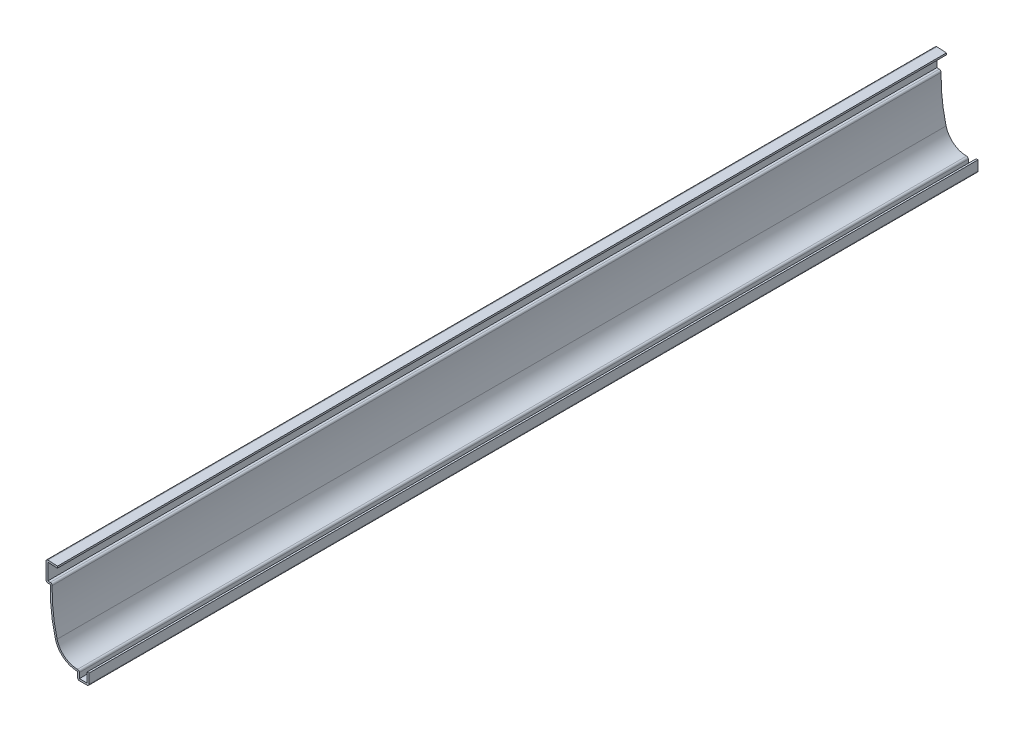
ISO-10303-21;
HEADER;
FILE_DESCRIPTION(('STEP AP214'),'2;1');
FILE_NAME('part.step','',(''),(''),'','','');
FILE_SCHEMA(('AUTOMOTIVE_DESIGN { 1 0 10303 214 1 1 1 1 }'));
ENDSEC;
DATA;
#1=APPLICATION_CONTEXT('core data for automotive mechanical design processes');
#2=APPLICATION_PROTOCOL_DEFINITION('international standard','automotive_design',2000,#1);
#3=PRODUCT_CONTEXT('',#1,'mechanical');
#4=PRODUCT('Part','Part','',(#3));
#5=PRODUCT_RELATED_PRODUCT_CATEGORY('part','',(#4));
#6=PRODUCT_DEFINITION_FORMATION('','',#4);
#7=PRODUCT_DEFINITION_CONTEXT('part definition',#1,'design');
#8=PRODUCT_DEFINITION('design','',#6,#7);
#9=PRODUCT_DEFINITION_SHAPE('','',#8);
#10=(LENGTH_UNIT() NAMED_UNIT(*) SI_UNIT(.MILLI.,.METRE.));
#11=(NAMED_UNIT(*) PLANE_ANGLE_UNIT() SI_UNIT($,.RADIAN.));
#12=(NAMED_UNIT(*) SI_UNIT($,.STERADIAN.) SOLID_ANGLE_UNIT());
#13=UNCERTAINTY_MEASURE_WITH_UNIT(LENGTH_MEASURE(1.E-05),#10,'distance_accuracy_value','');
#14=(GEOMETRIC_REPRESENTATION_CONTEXT(3) GLOBAL_UNCERTAINTY_ASSIGNED_CONTEXT((#13)) GLOBAL_UNIT_ASSIGNED_CONTEXT((#10,
#11,#12)) REPRESENTATION_CONTEXT('',''));
#15=CARTESIAN_POINT('',(0.,0.,0.));
#16=DIRECTION('',(0.,0.,1.));
#17=DIRECTION('',(1.,0.,0.));
#18=AXIS2_PLACEMENT_3D('',#15,#16,#17);
#19=CARTESIAN_POINT('',(-23.8656733315428,48.1978923926894,-492.125));
#20=DIRECTION('',(-0.0523359562429468,-0.998629534754574,0.));
#21=DIRECTION('',(0.998629534754574,-0.0523359562429468,0.));
#22=AXIS2_PLACEMENT_3D('',#19,#20,#21);
#23=PLANE('',#22);
#24=DIRECTION('',(0.998629534754574,-0.0523359562429468,0.));
#25=VECTOR('',#24,1.);
#26=CARTESIAN_POINT('',(-23.8656733315428,48.1978923926894,0.));
#27=LINE('',#26,#25);
#28=CARTESIAN_POINT('',(-22.7965,48.1418593927145,0.));
#29=VERTEX_POINT('',#28);
#30=CARTESIAN_POINT('',(-17.5156733315428,47.865102994242,0.));
#31=VERTEX_POINT('',#30);
#32=EDGE_CURVE('E264',#29,#31,#27,.T.);
#33=ORIENTED_EDGE('',*,*,#32,.F.);
#34=DIRECTION('',(0.,0.,1.));
#35=VECTOR('',#34,1.);
#36=CARTESIAN_POINT('',(-22.7965,48.1418593927145,-492.125));
#37=LINE('',#36,#35);
#38=CARTESIAN_POINT('',(-22.7965,48.1418593927145,-492.125));
#39=VERTEX_POINT('',#38);
#40=EDGE_CURVE('E221',#39,#29,#37,.T.);
#41=ORIENTED_EDGE('',*,*,#40,.F.);
#42=DIRECTION('',(0.998629534754574,-0.0523359562429468,0.));
#43=VECTOR('',#42,1.);
#44=CARTESIAN_POINT('',(-23.8656733315428,48.1978923926894,-492.125));
#45=LINE('',#44,#43);
#46=CARTESIAN_POINT('',(-17.5156733315428,47.865102994242,-492.125));
#47=VERTEX_POINT('',#46);
#48=EDGE_CURVE('E203',#39,#47,#45,.T.);
#49=ORIENTED_EDGE('',*,*,#48,.T.);
#50=DIRECTION('',(0.,0.,1.));
#51=VECTOR('',#50,1.);
#52=CARTESIAN_POINT('',(-17.5156733315428,47.865102994242,-492.125));
#53=LINE('',#52,#51);
#54=EDGE_CURVE('E211',#47,#31,#53,.T.);
#55=ORIENTED_EDGE('',*,*,#54,.T.);
#56=EDGE_LOOP('',(#33,#41,#49,#55));
#57=FACE_BOUND('',#56,.T.);
#58=ADVANCED_FACE('F35',(#57),#23,.T.);
#59=CARTESIAN_POINT('',(-22.7965,38.1,-492.125));
#60=DIRECTION('',(1.,0.,0.));
#61=DIRECTION('',(0.,0.,-1.));
#62=AXIS2_PLACEMENT_3D('',#59,#60,#61);
#63=PLANE('',#62);
#64=DIRECTION('',(0.,1.,0.));
#65=VECTOR('',#64,1.);
#66=CARTESIAN_POINT('',(-22.7965,38.1,0.));
#67=LINE('',#66,#65);
#68=CARTESIAN_POINT('',(-22.7965,39.116,0.));
#69=VERTEX_POINT('',#68);
#70=EDGE_CURVE('E222',#69,#29,#67,.T.);
#71=ORIENTED_EDGE('',*,*,#70,.F.);
#72=DIRECTION('',(0.,0.,1.));
#73=VECTOR('',#72,1.);
#74=CARTESIAN_POINT('',(-22.7965,39.116,-492.125));
#75=LINE('',#74,#73);
#76=CARTESIAN_POINT('',(-22.7965,39.116,-492.125));
#77=VERTEX_POINT('',#76);
#78=EDGE_CURVE('E305',#77,#69,#75,.T.);
#79=ORIENTED_EDGE('',*,*,#78,.F.);
#80=DIRECTION('',(0.,1.,0.));
#81=VECTOR('',#80,1.);
#82=CARTESIAN_POINT('',(-22.7965,38.1,-492.125));
#83=LINE('',#82,#81);
#84=EDGE_CURVE('E219',#77,#39,#83,.T.);
#85=ORIENTED_EDGE('',*,*,#84,.T.);
#86=ORIENTED_EDGE('',*,*,#40,.T.);
#87=EDGE_LOOP('',(#71,#79,#85,#86));
#88=FACE_BOUND('',#87,.T.);
#89=ADVANCED_FACE('F400',(#88),#63,.T.);
#90=CARTESIAN_POINT('',(-21.43125,39.116,-492.125));
#91=DIRECTION('',(0.,1.,0.));
#92=DIRECTION('',(0.,0.,1.));
#93=AXIS2_PLACEMENT_3D('',#90,#91,#92);
#94=PLANE('',#93);
#95=DIRECTION('',(1.,0.,0.));
#96=VECTOR('',#95,1.);
#97=CARTESIAN_POINT('',(-21.43125,39.116,0.));
#98=LINE('',#97,#96);
#99=CARTESIAN_POINT('',(-21.43125,39.116,0.));
#100=VERTEX_POINT('',#99);
#101=EDGE_CURVE('E225',#100,#69,#98,.F.);
#102=ORIENTED_EDGE('',*,*,#101,.F.);
#103=DIRECTION('',(0.,0.,1.));
#104=VECTOR('',#103,1.);
#105=CARTESIAN_POINT('',(-21.43125,39.116,-492.125));
#106=LINE('',#105,#104);
#107=CARTESIAN_POINT('',(-21.43125,39.116,-492.125));
#108=VERTEX_POINT('',#107);
#109=EDGE_CURVE('E370',#100,#108,#106,.F.);
#110=ORIENTED_EDGE('',*,*,#109,.T.);
#111=DIRECTION('',(1.,0.,0.));
#112=VECTOR('',#111,1.);
#113=CARTESIAN_POINT('',(-21.43125,39.116,-492.125));
#114=LINE('',#113,#112);
#115=EDGE_CURVE('E261',#108,#77,#114,.F.);
#116=ORIENTED_EDGE('',*,*,#115,.T.);
#117=ORIENTED_EDGE('',*,*,#78,.T.);
#118=EDGE_LOOP('',(#102,#110,#116,#117));
#119=FACE_BOUND('',#118,.T.);
#120=ADVANCED_FACE('F481',(#119),#94,.T.);
#121=CARTESIAN_POINT('',(67.436236515708,35.6958701406834,-492.125));
#122=DIRECTION('',(0.,0.,1.));
#123=DIRECTION('',(1.,0.,0.));
#124=AXIS2_PLACEMENT_3D('',#121,#122,#123);
#125=CYLINDRICAL_SURFACE('',#124,87.884);
#126=CARTESIAN_POINT('',(67.436236515708,35.6958701406834,-492.125));
#127=DIRECTION('',(0.,0.,1.));
#128=DIRECTION('',(1.,0.,0.));
#129=AXIS2_PLACEMENT_3D('',#126,#127,#128);
#130=CIRCLE('',#129,87.884);
#131=CARTESIAN_POINT('',(-17.6638895990753,13.7512582450952,-492.125));
#132=VERTEX_POINT('',#131);
#133=CARTESIAN_POINT('',(-20.4156215826776,38.0725242301792,-492.125));
#134=VERTEX_POINT('',#133);
#135=EDGE_CURVE('E258',#132,#134,#130,.F.);
#136=ORIENTED_EDGE('',*,*,#135,.T.);
#137=DIRECTION('',(0.,0.,1.));
#138=VECTOR('',#137,1.);
#139=CARTESIAN_POINT('',(-20.4156215826777,38.0725242301792,-492.125));
#140=LINE('',#139,#138);
#141=CARTESIAN_POINT('',(-20.4156215826776,38.0725242301792,0.));
#142=VERTEX_POINT('',#141);
#143=EDGE_CURVE('E367',#134,#142,#140,.T.);
#144=ORIENTED_EDGE('',*,*,#143,.T.);
#145=CARTESIAN_POINT('',(67.436236515708,35.6958701406834,0.));
#146=DIRECTION('',(0.,0.,1.));
#147=DIRECTION('',(1.,0.,0.));
#148=AXIS2_PLACEMENT_3D('',#145,#146,#147);
#149=CIRCLE('',#148,87.884);
#150=CARTESIAN_POINT('',(-17.6638895990753,13.7512582450952,0.));
#151=VERTEX_POINT('',#150);
#152=EDGE_CURVE('E299',#151,#142,#149,.F.);
#153=ORIENTED_EDGE('',*,*,#152,.F.);
#154=DIRECTION('',(0.,0.,1.));
#155=VECTOR('',#154,1.);
#156=CARTESIAN_POINT('',(-17.6638895990753,13.7512582450952,-492.125));
#157=LINE('',#156,#155);
#158=EDGE_CURVE('E308',#132,#151,#157,.T.);
#159=ORIENTED_EDGE('',*,*,#158,.F.);
#160=EDGE_LOOP('',(#136,#144,#153,#159));
#161=FACE_BOUND('',#160,.T.);
#162=ADVANCED_FACE('F411',(#161),#125,.F.);
#163=CARTESIAN_POINT('',(-6.35,16.66875,-492.125));
#164=DIRECTION('',(0.,0.,1.));
#165=DIRECTION('',(1.,0.,0.));
#166=AXIS2_PLACEMENT_3D('',#163,#164,#165);
#167=CYLINDRICAL_SURFACE('',#166,11.684);
#168=CARTESIAN_POINT('',(-6.35,16.66875,0.));
#169=DIRECTION('',(0.,0.,1.));
#170=DIRECTION('',(1.,0.,0.));
#171=AXIS2_PLACEMENT_3D('',#168,#169,#170);
#172=CIRCLE('',#171,11.684);
#173=CARTESIAN_POINT('',(-6.35,4.98474999999999,0.));
#174=VERTEX_POINT('',#173);
#175=EDGE_CURVE('E297',#174,#151,#172,.F.);
#176=ORIENTED_EDGE('',*,*,#175,.F.);
#177=DIRECTION('',(0.,0.,1.));
#178=VECTOR('',#177,1.);
#179=CARTESIAN_POINT('',(-6.35,4.98474999999999,-492.125));
#180=LINE('',#179,#178);
#181=CARTESIAN_POINT('',(-6.35,4.98474999999999,-492.125));
#182=VERTEX_POINT('',#181);
#183=EDGE_CURVE('E365',#174,#182,#180,.F.);
#184=ORIENTED_EDGE('',*,*,#183,.T.);
#185=CARTESIAN_POINT('',(-6.35,16.66875,-492.125));
#186=DIRECTION('',(0.,0.,1.));
#187=DIRECTION('',(1.,0.,0.));
#188=AXIS2_PLACEMENT_3D('',#185,#186,#187);
#189=CIRCLE('',#188,11.684);
#190=EDGE_CURVE('E256',#182,#132,#189,.F.);
#191=ORIENTED_EDGE('',*,*,#190,.T.);
#192=ORIENTED_EDGE('',*,*,#158,.T.);
#193=EDGE_LOOP('',(#176,#184,#191,#192));
#194=FACE_BOUND('',#193,.T.);
#195=ADVANCED_FACE('F416',(#194),#167,.F.);
#196=CARTESIAN_POINT('',(-5.334,0.,-492.125));
#197=DIRECTION('',(1.,0.,0.));
#198=DIRECTION('',(0.,1.,0.));
#199=AXIS2_PLACEMENT_3D('',#196,#197,#198);
#200=PLANE('',#199);
#201=DIRECTION('',(0.,1.,0.));
#202=VECTOR('',#201,1.);
#203=CARTESIAN_POINT('',(-5.334,0.,-492.125));
#204=LINE('',#203,#202);
#205=CARTESIAN_POINT('',(-5.334,1.016,-492.125));
#206=VERTEX_POINT('',#205);
#207=CARTESIAN_POINT('',(-5.334,3.96874999999999,-492.125));
#208=VERTEX_POINT('',#207);
#209=EDGE_CURVE('E253',#206,#208,#204,.T.);
#210=ORIENTED_EDGE('',*,*,#209,.T.);
#211=DIRECTION('',(0.,0.,1.));
#212=VECTOR('',#211,1.);
#213=CARTESIAN_POINT('',(-5.334,3.96874999999999,-492.125));
#214=LINE('',#213,#212);
#215=CARTESIAN_POINT('',(-5.334,3.96874999999999,0.));
#216=VERTEX_POINT('',#215);
#217=EDGE_CURVE('E362',#208,#216,#214,.T.);
#218=ORIENTED_EDGE('',*,*,#217,.T.);
#219=DIRECTION('',(0.,1.,0.));
#220=VECTOR('',#219,1.);
#221=CARTESIAN_POINT('',(-5.334,0.,0.));
#222=LINE('',#221,#220);
#223=CARTESIAN_POINT('',(-5.334,1.016,0.));
#224=VERTEX_POINT('',#223);
#225=EDGE_CURVE('E294',#224,#216,#222,.T.);
#226=ORIENTED_EDGE('',*,*,#225,.F.);
#227=DIRECTION('',(0.,0.,1.));
#228=VECTOR('',#227,1.);
#229=CARTESIAN_POINT('',(-5.334,1.016,-492.125));
#230=LINE('',#229,#228);
#231=EDGE_CURVE('E311',#206,#224,#230,.T.);
#232=ORIENTED_EDGE('',*,*,#231,.F.);
#233=EDGE_LOOP('',(#210,#218,#226,#232));
#234=FACE_BOUND('',#233,.T.);
#235=ADVANCED_FACE('F425',(#234),#200,.T.);
#236=CARTESIAN_POINT('',(0.,1.016,-492.125));
#237=DIRECTION('',(0.,1.,0.));
#238=DIRECTION('',(0.,0.,1.));
#239=AXIS2_PLACEMENT_3D('',#236,#237,#238);
#240=PLANE('',#239);
#241=DIRECTION('',(1.,0.,0.));
#242=VECTOR('',#241,1.);
#243=CARTESIAN_POINT('',(0.,1.016,0.));
#244=LINE('',#243,#242);
#245=CARTESIAN_POINT('',(-1.016,1.016,0.));
#246=VERTEX_POINT('',#245);
#247=EDGE_CURVE('E291',#246,#224,#244,.F.);
#248=ORIENTED_EDGE('',*,*,#247,.F.);
#249=DIRECTION('',(0.,0.,1.));
#250=VECTOR('',#249,1.);
#251=CARTESIAN_POINT('',(-1.016,1.016,-492.125));
#252=LINE('',#251,#250);
#253=CARTESIAN_POINT('',(-1.016,1.016,-492.125));
#254=VERTEX_POINT('',#253);
#255=EDGE_CURVE('E313',#254,#246,#252,.T.);
#256=ORIENTED_EDGE('',*,*,#255,.F.);
#257=DIRECTION('',(1.,0.,0.));
#258=VECTOR('',#257,1.);
#259=CARTESIAN_POINT('',(0.,1.016,-492.125));
#260=LINE('',#259,#258);
#261=EDGE_CURVE('E250',#254,#206,#260,.F.);
#262=ORIENTED_EDGE('',*,*,#261,.T.);
#263=ORIENTED_EDGE('',*,*,#231,.T.);
#264=EDGE_LOOP('',(#248,#256,#262,#263));
#265=FACE_BOUND('',#264,.T.);
#266=ADVANCED_FACE('F430',(#265),#240,.T.);
#267=CARTESIAN_POINT('',(-1.016,6.35,-492.125));
#268=DIRECTION('',(-1.,0.,0.));
#269=DIRECTION('',(0.,-1.,0.));
#270=AXIS2_PLACEMENT_3D('',#267,#268,#269);
#271=PLANE('',#270);
#272=DIRECTION('',(0.,-1.,0.));
#273=VECTOR('',#272,1.);
#274=CARTESIAN_POINT('',(-1.016,6.35,0.));
#275=LINE('',#274,#273);
#276=CARTESIAN_POINT('',(-1.016,6.35,0.));
#277=VERTEX_POINT('',#276);
#278=EDGE_CURVE('E288',#277,#246,#275,.T.);
#279=ORIENTED_EDGE('',*,*,#278,.F.);
#280=DIRECTION('',(0.,0.,1.));
#281=VECTOR('',#280,1.);
#282=CARTESIAN_POINT('',(-1.016,6.35,-492.125));
#283=LINE('',#282,#281);
#284=CARTESIAN_POINT('',(-1.016,6.35,-492.125));
#285=VERTEX_POINT('',#284);
#286=EDGE_CURVE('E315',#285,#277,#283,.T.);
#287=ORIENTED_EDGE('',*,*,#286,.F.);
#288=DIRECTION('',(0.,-1.,0.));
#289=VECTOR('',#288,1.);
#290=CARTESIAN_POINT('',(-1.016,6.35,-492.125));
#291=LINE('',#290,#289);
#292=EDGE_CURVE('E247',#285,#254,#291,.T.);
#293=ORIENTED_EDGE('',*,*,#292,.T.);
#294=ORIENTED_EDGE('',*,*,#255,.T.);
#295=EDGE_LOOP('',(#279,#287,#293,#294));
#296=FACE_BOUND('',#295,.T.);
#297=ADVANCED_FACE('F434',(#296),#271,.T.);
#298=CARTESIAN_POINT('',(-1.016,6.35,-492.125));
#299=DIRECTION('',(0.,-1.,0.));
#300=DIRECTION('',(0.,0.,-1.));
#301=AXIS2_PLACEMENT_3D('',#298,#299,#300);
#302=PLANE('',#301);
#303=DIRECTION('',(1.,0.,0.));
#304=VECTOR('',#303,1.);
#305=CARTESIAN_POINT('',(-1.016,6.35,0.));
#306=LINE('',#305,#304);
#307=CARTESIAN_POINT('',(0.,6.35,0.));
#308=VERTEX_POINT('',#307);
#309=EDGE_CURVE('E286',#277,#308,#306,.T.);
#310=ORIENTED_EDGE('',*,*,#309,.T.);
#311=DIRECTION('',(0.,0.,1.));
#312=VECTOR('',#311,1.);
#313=CARTESIAN_POINT('',(0.,6.35,-492.125));
#314=LINE('',#313,#312);
#315=CARTESIAN_POINT('',(0.,6.35,-492.125));
#316=VERTEX_POINT('',#315);
#317=EDGE_CURVE('E317',#316,#308,#314,.T.);
#318=ORIENTED_EDGE('',*,*,#317,.F.);
#319=DIRECTION('',(1.,0.,0.));
#320=VECTOR('',#319,1.);
#321=CARTESIAN_POINT('',(-1.016,6.35,-492.125));
#322=LINE('',#321,#320);
#323=EDGE_CURVE('E245',#285,#316,#322,.T.);
#324=ORIENTED_EDGE('',*,*,#323,.F.);
#325=ORIENTED_EDGE('',*,*,#286,.T.);
#326=EDGE_LOOP('',(#310,#318,#324,#325));
#327=FACE_BOUND('',#326,.T.);
#328=ADVANCED_FACE('F438',(#327),#302,.F.);
#329=CARTESIAN_POINT('',(0.,6.35,-492.125));
#330=DIRECTION('',(-1.,0.,0.));
#331=DIRECTION('',(0.,-1.,0.));
#332=AXIS2_PLACEMENT_3D('',#329,#330,#331);
#333=PLANE('',#332);
#334=DIRECTION('',(0.,-1.,0.));
#335=VECTOR('',#334,1.);
#336=CARTESIAN_POINT('',(0.,6.35,0.));
#337=LINE('',#336,#335);
#338=CARTESIAN_POINT('',(0.,1.016,0.));
#339=VERTEX_POINT('',#338);
#340=EDGE_CURVE('E283',#308,#339,#337,.T.);
#341=ORIENTED_EDGE('',*,*,#340,.T.);
#342=DIRECTION('',(0.,0.,1.));
#343=VECTOR('',#342,1.);
#344=CARTESIAN_POINT('',(0.,1.016,-492.125));
#345=LINE('',#344,#343);
#346=CARTESIAN_POINT('',(0.,1.016,-492.125));
#347=VERTEX_POINT('',#346);
#348=EDGE_CURVE('E346',#339,#347,#345,.F.);
#349=ORIENTED_EDGE('',*,*,#348,.T.);
#350=DIRECTION('',(0.,-1.,0.));
#351=VECTOR('',#350,1.);
#352=CARTESIAN_POINT('',(0.,6.35,-492.125));
#353=LINE('',#352,#351);
#354=EDGE_CURVE('E243',#316,#347,#353,.T.);
#355=ORIENTED_EDGE('',*,*,#354,.F.);
#356=ORIENTED_EDGE('',*,*,#317,.T.);
#357=EDGE_LOOP('',(#341,#349,#355,#356));
#358=FACE_BOUND('',#357,.T.);
#359=ADVANCED_FACE('F586',(#358),#333,.F.);
#360=CARTESIAN_POINT('',(0.,0.,-492.125));
#361=DIRECTION('',(0.,1.,0.));
#362=DIRECTION('',(0.,0.,1.));
#363=AXIS2_PLACEMENT_3D('',#360,#361,#362);
#364=PLANE('',#363);
#365=DIRECTION('',(-1.,0.,0.));
#366=VECTOR('',#365,1.);
#367=CARTESIAN_POINT('',(0.,0.,-492.125));
#368=LINE('',#367,#366);
#369=CARTESIAN_POINT('',(-1.016,0.,-492.125));
#370=VERTEX_POINT('',#369);
#371=CARTESIAN_POINT('',(-5.334,0.,-492.125));
#372=VERTEX_POINT('',#371);
#373=EDGE_CURVE('E240',#370,#372,#368,.T.);
#374=ORIENTED_EDGE('',*,*,#373,.F.);
#375=DIRECTION('',(0.,0.,1.));
#376=VECTOR('',#375,1.);
#377=CARTESIAN_POINT('',(-1.016,0.,-492.125));
#378=LINE('',#377,#376);
#379=CARTESIAN_POINT('',(-1.016,0.,0.));
#380=VERTEX_POINT('',#379);
#381=EDGE_CURVE('E331',#370,#380,#378,.T.);
#382=ORIENTED_EDGE('',*,*,#381,.T.);
#383=DIRECTION('',(-1.,0.,0.));
#384=VECTOR('',#383,1.);
#385=CARTESIAN_POINT('',(0.,0.,0.));
#386=LINE('',#385,#384);
#387=CARTESIAN_POINT('',(-5.334,0.,0.));
#388=VERTEX_POINT('',#387);
#389=EDGE_CURVE('E280',#380,#388,#386,.T.);
#390=ORIENTED_EDGE('',*,*,#389,.T.);
#391=DIRECTION('',(0.,0.,1.));
#392=VECTOR('',#391,1.);
#393=CARTESIAN_POINT('',(-5.334,0.,-492.125));
#394=LINE('',#393,#392);
#395=EDGE_CURVE('E304',#388,#372,#394,.F.);
#396=ORIENTED_EDGE('',*,*,#395,.T.);
#397=EDGE_LOOP('',(#374,#382,#390,#396));
#398=FACE_BOUND('',#397,.T.);
#399=ADVANCED_FACE('F448',(#398),#364,.F.);
#400=CARTESIAN_POINT('',(-6.35,0.,-492.125));
#401=DIRECTION('',(1.,0.,0.));
#402=DIRECTION('',(0.,1.,0.));
#403=AXIS2_PLACEMENT_3D('',#400,#401,#402);
#404=PLANE('',#403);
#405=DIRECTION('',(0.,1.,0.));
#406=VECTOR('',#405,1.);
#407=CARTESIAN_POINT('',(-6.35,0.,-492.125));
#408=LINE('',#407,#406);
#409=CARTESIAN_POINT('',(-6.35,1.016,-492.125));
#410=VERTEX_POINT('',#409);
#411=CARTESIAN_POINT('',(-6.35,3.96875,-492.125));
#412=VERTEX_POINT('',#411);
#413=EDGE_CURVE('E238',#410,#412,#408,.T.);
#414=ORIENTED_EDGE('',*,*,#413,.F.);
#415=DIRECTION('',(0.,0.,1.));
#416=VECTOR('',#415,1.);
#417=CARTESIAN_POINT('',(-6.35,1.016,-492.125));
#418=LINE('',#417,#416);
#419=CARTESIAN_POINT('',(-6.35,1.016,0.));
#420=VERTEX_POINT('',#419);
#421=EDGE_CURVE('E359',#410,#420,#418,.T.);
#422=ORIENTED_EDGE('',*,*,#421,.T.);
#423=DIRECTION('',(0.,1.,0.));
#424=VECTOR('',#423,1.);
#425=CARTESIAN_POINT('',(-6.35,0.,0.));
#426=LINE('',#425,#424);
#427=CARTESIAN_POINT('',(-6.35,3.96875,0.));
#428=VERTEX_POINT('',#427);
#429=EDGE_CURVE('E278',#420,#428,#426,.T.);
#430=ORIENTED_EDGE('',*,*,#429,.T.);
#431=DIRECTION('',(0.,0.,1.));
#432=VECTOR('',#431,1.);
#433=CARTESIAN_POINT('',(-6.35,3.96875,-492.125));
#434=LINE('',#433,#432);
#435=EDGE_CURVE('E320',#412,#428,#434,.T.);
#436=ORIENTED_EDGE('',*,*,#435,.F.);
#437=EDGE_LOOP('',(#414,#422,#430,#436));
#438=FACE_BOUND('',#437,.T.);
#439=ADVANCED_FACE('F459',(#438),#404,.F.);
#440=CARTESIAN_POINT('',(-6.35,16.66875,-492.125));
#441=DIRECTION('',(0.,0.,1.));
#442=DIRECTION('',(1.,0.,0.));
#443=AXIS2_PLACEMENT_3D('',#440,#441,#442);
#444=CYLINDRICAL_SURFACE('',#443,12.7);
#445=CARTESIAN_POINT('',(-6.35,16.66875,0.));
#446=DIRECTION('',(0.,0.,-1.));
#447=DIRECTION('',(-1.,0.,0.));
#448=AXIS2_PLACEMENT_3D('',#445,#446,#447);
#449=CIRCLE('',#448,12.7);
#450=CARTESIAN_POINT('',(-18.6477060859513,13.4975633098861,0.));
#451=VERTEX_POINT('',#450);
#452=EDGE_CURVE('E276',#428,#451,#449,.T.);
#453=ORIENTED_EDGE('',*,*,#452,.T.);
#454=DIRECTION('',(0.,0.,1.));
#455=VECTOR('',#454,1.);
#456=CARTESIAN_POINT('',(-18.6477060859513,13.4975633098861,-492.125));
#457=LINE('',#456,#455);
#458=CARTESIAN_POINT('',(-18.6477060859513,13.4975633098861,-492.125));
#459=VERTEX_POINT('',#458);
#460=EDGE_CURVE('E323',#459,#451,#457,.T.);
#461=ORIENTED_EDGE('',*,*,#460,.F.);
#462=CARTESIAN_POINT('',(-6.35,16.66875,-492.125));
#463=DIRECTION('',(0.,0.,-1.));
#464=DIRECTION('',(-1.,0.,0.));
#465=AXIS2_PLACEMENT_3D('',#462,#463,#464);
#466=CIRCLE('',#465,12.7);
#467=EDGE_CURVE('E236',#412,#459,#466,.T.);
#468=ORIENTED_EDGE('',*,*,#467,.F.);
#469=ORIENTED_EDGE('',*,*,#435,.T.);
#470=EDGE_LOOP('',(#453,#461,#468,#469));
#471=FACE_BOUND('',#470,.T.);
#472=ADVANCED_FACE('F464',(#471),#444,.T.);
#473=CARTESIAN_POINT('',(67.436236515708,35.6958701406834,-492.125));
#474=DIRECTION('',(0.,0.,1.));
#475=DIRECTION('',(1.,0.,0.));
#476=AXIS2_PLACEMENT_3D('',#473,#474,#475);
#477=CYLINDRICAL_SURFACE('',#476,88.9);
#478=CARTESIAN_POINT('',(67.436236515708,35.6958701406834,0.));
#479=DIRECTION('',(0.,0.,-1.));
#480=DIRECTION('',(-1.,0.,0.));
#481=AXIS2_PLACEMENT_3D('',#478,#479,#480);
#482=CIRCLE('',#481,88.9);
#483=CARTESIAN_POINT('',(-21.43125,38.1,0.));
#484=VERTEX_POINT('',#483);
#485=EDGE_CURVE('E274',#451,#484,#482,.T.);
#486=ORIENTED_EDGE('',*,*,#485,.T.);
#487=DIRECTION('',(0.,0.,1.));
#488=VECTOR('',#487,1.);
#489=CARTESIAN_POINT('',(-21.43125,38.1,-492.125));
#490=LINE('',#489,#488);
#491=CARTESIAN_POINT('',(-21.43125,38.1,-492.125));
#492=VERTEX_POINT('',#491);
#493=EDGE_CURVE('E326',#492,#484,#490,.T.);
#494=ORIENTED_EDGE('',*,*,#493,.F.);
#495=CARTESIAN_POINT('',(67.436236515708,35.6958701406834,-492.125));
#496=DIRECTION('',(0.,0.,-1.));
#497=DIRECTION('',(-1.,0.,0.));
#498=AXIS2_PLACEMENT_3D('',#495,#496,#497);
#499=CIRCLE('',#498,88.9);
#500=EDGE_CURVE('E234',#459,#492,#499,.T.);
#501=ORIENTED_EDGE('',*,*,#500,.F.);
#502=ORIENTED_EDGE('',*,*,#460,.T.);
#503=EDGE_LOOP('',(#486,#494,#501,#502));
#504=FACE_BOUND('',#503,.T.);
#505=ADVANCED_FACE('F467',(#504),#477,.T.);
#506=CARTESIAN_POINT('',(-21.43125,38.1,-492.125));
#507=DIRECTION('',(0.,1.,0.));
#508=DIRECTION('',(0.,0.,1.));
#509=AXIS2_PLACEMENT_3D('',#506,#507,#508);
#510=PLANE('',#509);
#511=DIRECTION('',(-1.,0.,0.));
#512=VECTOR('',#511,1.);
#513=CARTESIAN_POINT('',(-21.43125,38.1,0.));
#514=LINE('',#513,#512);
#515=CARTESIAN_POINT('',(-22.7965,38.1,0.));
#516=VERTEX_POINT('',#515);
#517=EDGE_CURVE('E271',#484,#516,#514,.T.);
#518=ORIENTED_EDGE('',*,*,#517,.T.);
#519=DIRECTION('',(0.,0.,1.));
#520=VECTOR('',#519,1.);
#521=CARTESIAN_POINT('',(-22.7965,38.1,-492.125));
#522=LINE('',#521,#520);
#523=CARTESIAN_POINT('',(-22.7965,38.1,-492.125));
#524=VERTEX_POINT('',#523);
#525=EDGE_CURVE('E43',#516,#524,#522,.F.);
#526=ORIENTED_EDGE('',*,*,#525,.T.);
#527=DIRECTION('',(-1.,0.,0.));
#528=VECTOR('',#527,1.);
#529=CARTESIAN_POINT('',(-21.43125,38.1,-492.125));
#530=LINE('',#529,#528);
#531=EDGE_CURVE('E231',#492,#524,#530,.T.);
#532=ORIENTED_EDGE('',*,*,#531,.F.);
#533=ORIENTED_EDGE('',*,*,#493,.T.);
#534=EDGE_LOOP('',(#518,#526,#532,#533));
#535=FACE_BOUND('',#534,.T.);
#536=ADVANCED_FACE('F378',(#535),#510,.F.);
#537=CARTESIAN_POINT('',(-23.8125,38.1,-492.125));
#538=DIRECTION('',(1.,0.,0.));
#539=DIRECTION('',(0.,0.,-1.));
#540=AXIS2_PLACEMENT_3D('',#537,#538,#539);
#541=PLANE('',#540);
#542=DIRECTION('',(0.,1.,0.));
#543=VECTOR('',#542,1.);
#544=CARTESIAN_POINT('',(-23.8125,38.1,-492.125));
#545=LINE('',#544,#543);
#546=CARTESIAN_POINT('',(-23.8125,39.116,-492.125));
#547=VERTEX_POINT('',#546);
#548=CARTESIAN_POINT('',(-23.8125,48.1418593927145,-492.125));
#549=VERTEX_POINT('',#548);
#550=EDGE_CURVE('E229',#547,#549,#545,.T.);
#551=ORIENTED_EDGE('',*,*,#550,.F.);
#552=DIRECTION('',(0.,0.,1.));
#553=VECTOR('',#552,1.);
#554=CARTESIAN_POINT('',(-23.8125,39.116,-492.125));
#555=LINE('',#554,#553);
#556=CARTESIAN_POINT('',(-23.8125,39.116,0.));
#557=VERTEX_POINT('',#556);
#558=EDGE_CURVE('E373',#547,#557,#555,.T.);
#559=ORIENTED_EDGE('',*,*,#558,.T.);
#560=DIRECTION('',(0.,1.,0.));
#561=VECTOR('',#560,1.);
#562=CARTESIAN_POINT('',(-23.8125,38.1,0.));
#563=LINE('',#562,#561);
#564=CARTESIAN_POINT('',(-23.8125,48.1418593927145,0.));
#565=VERTEX_POINT('',#564);
#566=EDGE_CURVE('E269',#557,#565,#563,.T.);
#567=ORIENTED_EDGE('',*,*,#566,.T.);
#568=DIRECTION('',(0.,0.,1.));
#569=VECTOR('',#568,1.);
#570=CARTESIAN_POINT('',(-23.8125,48.1418593927145,-492.125));
#571=LINE('',#570,#569);
#572=EDGE_CURVE('E58',#565,#549,#571,.F.);
#573=ORIENTED_EDGE('',*,*,#572,.T.);
#574=EDGE_LOOP('',(#551,#559,#567,#573));
#575=FACE_BOUND('',#574,.T.);
#576=ADVANCED_FACE('F387',(#575),#541,.F.);
#577=CARTESIAN_POINT('',(-23.8125,49.2125,-492.125));
#578=DIRECTION('',(-0.0523359562429468,-0.998629534754574,0.));
#579=DIRECTION('',(0.998629534754574,-0.0523359562429468,0.));
#580=AXIS2_PLACEMENT_3D('',#577,#578,#579);
#581=PLANE('',#580);
#582=DIRECTION('',(0.998629534754574,-0.0523359562429468,0.));
#583=VECTOR('',#582,1.);
#584=CARTESIAN_POINT('',(-23.8125,49.2125,-492.125));
#585=LINE('',#584,#583);
#586=CARTESIAN_POINT('',(-22.7433266684572,49.1564670000252,-492.125));
#587=VERTEX_POINT('',#586);
#588=CARTESIAN_POINT('',(-17.4625,48.8797106015527,-492.125));
#589=VERTEX_POINT('',#588);
#590=EDGE_CURVE('E205',#587,#589,#585,.T.);
#591=ORIENTED_EDGE('',*,*,#590,.F.);
#592=DIRECTION('',(0.,0.,1.));
#593=VECTOR('',#592,1.);
#594=CARTESIAN_POINT('',(-22.7433266684572,49.1564670000252,-492.125));
#595=LINE('',#594,#593);
#596=CARTESIAN_POINT('',(-22.7433266684572,49.1564670000252,0.));
#597=VERTEX_POINT('',#596);
#598=EDGE_CURVE('E11',#587,#597,#595,.T.);
#599=ORIENTED_EDGE('',*,*,#598,.T.);
#600=DIRECTION('',(0.998629534754574,-0.0523359562429468,0.));
#601=VECTOR('',#600,1.);
#602=CARTESIAN_POINT('',(-23.8125,49.2125,0.));
#603=LINE('',#602,#601);
#604=CARTESIAN_POINT('',(-17.4625,48.8797106015527,0.));
#605=VERTEX_POINT('',#604);
#606=EDGE_CURVE('E267',#597,#605,#603,.T.);
#607=ORIENTED_EDGE('',*,*,#606,.T.);
#608=DIRECTION('',(0.,0.,1.));
#609=VECTOR('',#608,1.);
#610=CARTESIAN_POINT('',(-17.4625,48.8797106015527,-492.125));
#611=LINE('',#610,#609);
#612=EDGE_CURVE('E218',#589,#605,#611,.T.);
#613=ORIENTED_EDGE('',*,*,#612,.F.);
#614=EDGE_LOOP('',(#591,#599,#607,#613));
#615=FACE_BOUND('',#614,.T.);
#616=ADVANCED_FACE('F395',(#615),#581,.F.);
#617=CARTESIAN_POINT('',(-17.4625,48.8797106015527,-492.125));
#618=DIRECTION('',(-0.998629534754574,0.0523359562429444,0.));
#619=DIRECTION('',(-0.0523359562429444,-0.998629534754574,0.));
#620=AXIS2_PLACEMENT_3D('',#617,#618,#619);
#621=PLANE('',#620);
#622=DIRECTION('',(-0.0523359562429444,-0.998629534754574,0.));
#623=VECTOR('',#622,1.);
#624=CARTESIAN_POINT('',(-17.4625,48.8797106015527,0.));
#625=LINE('',#624,#623);
#626=EDGE_CURVE('E214',#605,#31,#625,.T.);
#627=ORIENTED_EDGE('',*,*,#626,.T.);
#628=ORIENTED_EDGE('',*,*,#54,.F.);
#629=DIRECTION('',(-0.0523359562429444,-0.998629534754574,0.));
#630=VECTOR('',#629,1.);
#631=CARTESIAN_POINT('',(-17.4625,48.8797106015527,-492.125));
#632=LINE('',#631,#630);
#633=EDGE_CURVE('E197',#589,#47,#632,.T.);
#634=ORIENTED_EDGE('',*,*,#633,.F.);
#635=ORIENTED_EDGE('',*,*,#612,.T.);
#636=EDGE_LOOP('',(#627,#628,#634,#635));
#637=FACE_BOUND('',#636,.T.);
#638=ADVANCED_FACE('F212',(#637),#621,.F.);
#639=CARTESIAN_POINT('',(67.436236515708,35.6958701406834,-492.125));
#640=DIRECTION('',(0.,0.,-1.));
#641=DIRECTION('',(-1.,0.,0.));
#642=AXIS2_PLACEMENT_3D('',#639,#640,#641);
#643=PLANE('',#642);
#644=ORIENTED_EDGE('',*,*,#354,.T.);
#645=CARTESIAN_POINT('',(-1.016,1.016,-492.125));
#646=DIRECTION('',(0.,0.,-1.));
#647=DIRECTION('',(-1.,0.,0.));
#648=AXIS2_PLACEMENT_3D('',#645,#646,#647);
#649=CIRCLE('',#648,1.016);
#650=EDGE_CURVE('E357',#347,#370,#649,.T.);
#651=ORIENTED_EDGE('',*,*,#650,.T.);
#652=ORIENTED_EDGE('',*,*,#373,.T.);
#653=CARTESIAN_POINT('',(-5.334,1.016,-492.125));
#654=DIRECTION('',(0.,0.,-1.));
#655=DIRECTION('',(-1.,0.,0.));
#656=AXIS2_PLACEMENT_3D('',#653,#654,#655);
#657=CIRCLE('',#656,1.016);
#658=EDGE_CURVE('E355',#372,#410,#657,.T.);
#659=ORIENTED_EDGE('',*,*,#658,.T.);
#660=ORIENTED_EDGE('',*,*,#413,.T.);
#661=ORIENTED_EDGE('',*,*,#467,.T.);
#662=ORIENTED_EDGE('',*,*,#500,.T.);
#663=ORIENTED_EDGE('',*,*,#531,.T.);
#664=CARTESIAN_POINT('',(-22.7965,39.116,-492.125));
#665=DIRECTION('',(0.,0.,-1.));
#666=DIRECTION('',(-1.,0.,0.));
#667=AXIS2_PLACEMENT_3D('',#664,#665,#666);
#668=CIRCLE('',#667,1.016);
#669=EDGE_CURVE('E349',#524,#547,#668,.T.);
#670=ORIENTED_EDGE('',*,*,#669,.T.);
#671=ORIENTED_EDGE('',*,*,#550,.T.);
#672=CARTESIAN_POINT('',(-22.7965,48.1418593927145,-492.125));
#673=DIRECTION('',(0.,0.,-1.));
#674=DIRECTION('',(-1.,0.,0.));
#675=AXIS2_PLACEMENT_3D('',#672,#673,#674);
#676=CIRCLE('',#675,1.016);
#677=EDGE_CURVE('E50',#549,#587,#676,.T.);
#678=ORIENTED_EDGE('',*,*,#677,.T.);
#679=ORIENTED_EDGE('',*,*,#590,.T.);
#680=ORIENTED_EDGE('',*,*,#633,.T.);
#681=ORIENTED_EDGE('',*,*,#48,.F.);
#682=ORIENTED_EDGE('',*,*,#84,.F.);
#683=ORIENTED_EDGE('',*,*,#115,.F.);
#684=CARTESIAN_POINT('',(-21.43125,38.1,-492.125));
#685=DIRECTION('',(0.,0.,-1.));
#686=DIRECTION('',(-1.,0.,0.));
#687=AXIS2_PLACEMENT_3D('',#684,#685,#686);
#688=CIRCLE('',#687,1.016);
#689=EDGE_CURVE('E351',#108,#134,#688,.T.);
#690=ORIENTED_EDGE('',*,*,#689,.T.);
#691=ORIENTED_EDGE('',*,*,#135,.F.);
#692=ORIENTED_EDGE('',*,*,#190,.F.);
#693=CARTESIAN_POINT('',(-6.35,3.96874999999999,-492.125));
#694=DIRECTION('',(0.,0.,-1.));
#695=DIRECTION('',(-1.,0.,0.));
#696=AXIS2_PLACEMENT_3D('',#693,#694,#695);
#697=CIRCLE('',#696,1.016);
#698=EDGE_CURVE('E353',#182,#208,#697,.T.);
#699=ORIENTED_EDGE('',*,*,#698,.T.);
#700=ORIENTED_EDGE('',*,*,#209,.F.);
#701=ORIENTED_EDGE('',*,*,#261,.F.);
#702=ORIENTED_EDGE('',*,*,#292,.F.);
#703=ORIENTED_EDGE('',*,*,#323,.T.);
#704=EDGE_LOOP('',(#644,#651,#652,#659,#660,#661,#662,#663,#670,#671,#678,#679,#680,#681,#682,
#683,#690,#691,#692,#699,#700,#701,#702,#703));
#705=FACE_BOUND('',#704,.T.);
#706=ADVANCED_FACE('F200',(#705),#643,.T.);
#707=CARTESIAN_POINT('',(67.436236515708,35.6958701406834,0.));
#708=DIRECTION('',(0.,0.,-1.));
#709=DIRECTION('',(-1.,0.,0.));
#710=AXIS2_PLACEMENT_3D('',#707,#708,#709);
#711=PLANE('',#710);
#712=ORIENTED_EDGE('',*,*,#389,.F.);
#713=CARTESIAN_POINT('',(-1.016,1.016,0.));
#714=DIRECTION('',(0.,0.,-1.));
#715=DIRECTION('',(-1.,0.,0.));
#716=AXIS2_PLACEMENT_3D('',#713,#714,#715);
#717=CIRCLE('',#716,1.016);
#718=EDGE_CURVE('E344',#380,#339,#717,.F.);
#719=ORIENTED_EDGE('',*,*,#718,.T.);
#720=ORIENTED_EDGE('',*,*,#340,.F.);
#721=ORIENTED_EDGE('',*,*,#309,.F.);
#722=ORIENTED_EDGE('',*,*,#278,.T.);
#723=ORIENTED_EDGE('',*,*,#247,.T.);
#724=ORIENTED_EDGE('',*,*,#225,.T.);
#725=CARTESIAN_POINT('',(-6.35,3.96874999999999,0.));
#726=DIRECTION('',(0.,0.,-1.));
#727=DIRECTION('',(-1.,0.,0.));
#728=AXIS2_PLACEMENT_3D('',#725,#726,#727);
#729=CIRCLE('',#728,1.016);
#730=EDGE_CURVE('E340',#216,#174,#729,.F.);
#731=ORIENTED_EDGE('',*,*,#730,.T.);
#732=ORIENTED_EDGE('',*,*,#175,.T.);
#733=ORIENTED_EDGE('',*,*,#152,.T.);
#734=CARTESIAN_POINT('',(-21.43125,38.1,0.));
#735=DIRECTION('',(0.,0.,-1.));
#736=DIRECTION('',(-1.,0.,0.));
#737=AXIS2_PLACEMENT_3D('',#734,#735,#736);
#738=CIRCLE('',#737,1.016);
#739=EDGE_CURVE('E338',#142,#100,#738,.F.);
#740=ORIENTED_EDGE('',*,*,#739,.T.);
#741=ORIENTED_EDGE('',*,*,#101,.T.);
#742=ORIENTED_EDGE('',*,*,#70,.T.);
#743=ORIENTED_EDGE('',*,*,#32,.T.);
#744=ORIENTED_EDGE('',*,*,#626,.F.);
#745=ORIENTED_EDGE('',*,*,#606,.F.);
#746=CARTESIAN_POINT('',(-22.7965,48.1418593927145,0.));
#747=DIRECTION('',(0.,0.,-1.));
#748=DIRECTION('',(-1.,0.,0.));
#749=AXIS2_PLACEMENT_3D('',#746,#747,#748);
#750=CIRCLE('',#749,1.016);
#751=EDGE_CURVE('E334',#597,#565,#750,.F.);
#752=ORIENTED_EDGE('',*,*,#751,.T.);
#753=ORIENTED_EDGE('',*,*,#566,.F.);
#754=CARTESIAN_POINT('',(-22.7965,39.116,0.));
#755=DIRECTION('',(0.,0.,-1.));
#756=DIRECTION('',(-1.,0.,0.));
#757=AXIS2_PLACEMENT_3D('',#754,#755,#756);
#758=CIRCLE('',#757,1.016);
#759=EDGE_CURVE('E336',#557,#516,#758,.F.);
#760=ORIENTED_EDGE('',*,*,#759,.T.);
#761=ORIENTED_EDGE('',*,*,#517,.F.);
#762=ORIENTED_EDGE('',*,*,#485,.F.);
#763=ORIENTED_EDGE('',*,*,#452,.F.);
#764=ORIENTED_EDGE('',*,*,#429,.F.);
#765=CARTESIAN_POINT('',(-5.334,1.016,0.));
#766=DIRECTION('',(0.,0.,-1.));
#767=DIRECTION('',(-1.,0.,0.));
#768=AXIS2_PLACEMENT_3D('',#765,#766,#767);
#769=CIRCLE('',#768,1.016);
#770=EDGE_CURVE('E342',#420,#388,#769,.F.);
#771=ORIENTED_EDGE('',*,*,#770,.T.);
#772=EDGE_LOOP('',(#712,#719,#720,#721,#722,#723,#724,#731,#732,#733,#740,#741,#742,#743,#744,
#745,#752,#753,#760,#761,#762,#763,#764,#771));
#773=FACE_BOUND('',#772,.T.);
#774=ADVANCED_FACE('F390',(#773),#711,.F.);
#775=CARTESIAN_POINT('',(-1.016,1.016,-492.125));
#776=DIRECTION('',(0.,0.,1.));
#777=DIRECTION('',(1.,0.,0.));
#778=AXIS2_PLACEMENT_3D('',#775,#776,#777);
#779=CYLINDRICAL_SURFACE('',#778,1.016);
#780=ORIENTED_EDGE('',*,*,#650,.F.);
#781=ORIENTED_EDGE('',*,*,#348,.F.);
#782=ORIENTED_EDGE('',*,*,#718,.F.);
#783=ORIENTED_EDGE('',*,*,#381,.F.);
#784=EDGE_LOOP('',(#780,#781,#782,#783));
#785=FACE_BOUND('',#784,.T.);
#786=ADVANCED_FACE('F446',(#785),#779,.T.);
#787=CARTESIAN_POINT('',(-5.334,1.016,-492.125));
#788=DIRECTION('',(0.,0.,1.));
#789=DIRECTION('',(1.,0.,0.));
#790=AXIS2_PLACEMENT_3D('',#787,#788,#789);
#791=CYLINDRICAL_SURFACE('',#790,1.016);
#792=ORIENTED_EDGE('',*,*,#658,.F.);
#793=ORIENTED_EDGE('',*,*,#395,.F.);
#794=ORIENTED_EDGE('',*,*,#770,.F.);
#795=ORIENTED_EDGE('',*,*,#421,.F.);
#796=EDGE_LOOP('',(#792,#793,#794,#795));
#797=FACE_BOUND('',#796,.T.);
#798=ADVANCED_FACE('F456',(#797),#791,.T.);
#799=CARTESIAN_POINT('',(-6.35,3.96874999999999,-492.125));
#800=DIRECTION('',(0.,0.,1.));
#801=DIRECTION('',(1.,0.,0.));
#802=AXIS2_PLACEMENT_3D('',#799,#800,#801);
#803=CYLINDRICAL_SURFACE('',#802,1.016);
#804=ORIENTED_EDGE('',*,*,#698,.F.);
#805=ORIENTED_EDGE('',*,*,#183,.F.);
#806=ORIENTED_EDGE('',*,*,#730,.F.);
#807=ORIENTED_EDGE('',*,*,#217,.F.);
#808=EDGE_LOOP('',(#804,#805,#806,#807));
#809=FACE_BOUND('',#808,.T.);
#810=ADVANCED_FACE('F422',(#809),#803,.T.);
#811=CARTESIAN_POINT('',(-21.43125,38.1,-492.125));
#812=DIRECTION('',(0.,0.,1.));
#813=DIRECTION('',(1.,0.,0.));
#814=AXIS2_PLACEMENT_3D('',#811,#812,#813);
#815=CYLINDRICAL_SURFACE('',#814,1.016);
#816=ORIENTED_EDGE('',*,*,#689,.F.);
#817=ORIENTED_EDGE('',*,*,#109,.F.);
#818=ORIENTED_EDGE('',*,*,#739,.F.);
#819=ORIENTED_EDGE('',*,*,#143,.F.);
#820=EDGE_LOOP('',(#816,#817,#818,#819));
#821=FACE_BOUND('',#820,.T.);
#822=ADVANCED_FACE('F408',(#821),#815,.T.);
#823=CARTESIAN_POINT('',(-22.7965,39.116,-492.125));
#824=DIRECTION('',(0.,0.,1.));
#825=DIRECTION('',(1.,0.,0.));
#826=AXIS2_PLACEMENT_3D('',#823,#824,#825);
#827=CYLINDRICAL_SURFACE('',#826,1.016);
#828=ORIENTED_EDGE('',*,*,#669,.F.);
#829=ORIENTED_EDGE('',*,*,#525,.F.);
#830=ORIENTED_EDGE('',*,*,#759,.F.);
#831=ORIENTED_EDGE('',*,*,#558,.F.);
#832=EDGE_LOOP('',(#828,#829,#830,#831));
#833=FACE_BOUND('',#832,.T.);
#834=ADVANCED_FACE('F385',(#833),#827,.T.);
#835=CARTESIAN_POINT('',(-22.7965,48.1418593927145,-492.125));
#836=DIRECTION('',(0.,0.,1.));
#837=DIRECTION('',(1.,0.,0.));
#838=AXIS2_PLACEMENT_3D('',#835,#836,#837);
#839=CYLINDRICAL_SURFACE('',#838,1.016);
#840=ORIENTED_EDGE('',*,*,#677,.F.);
#841=ORIENTED_EDGE('',*,*,#572,.F.);
#842=ORIENTED_EDGE('',*,*,#751,.F.);
#843=ORIENTED_EDGE('',*,*,#598,.F.);
#844=EDGE_LOOP('',(#840,#841,#842,#843));
#845=FACE_BOUND('',#844,.T.);
#846=ADVANCED_FACE('F37',(#845),#839,.T.);
#847=CLOSED_SHELL('',(#58,#89,#120,#162,#195,#235,#266,#297,#328,#359,#399,#439,#472,#505,#536,
#576,#616,#638,#706,#774,#786,#798,#810,#822,#834,#846));
#848=MANIFOLD_SOLID_BREP('B2',#847);
#849=ADVANCED_BREP_SHAPE_REPRESENTATION('',(#18,#848),#14);
#850=SHAPE_DEFINITION_REPRESENTATION(#9,#849);
ENDSEC;
END-ISO-10303-21;
